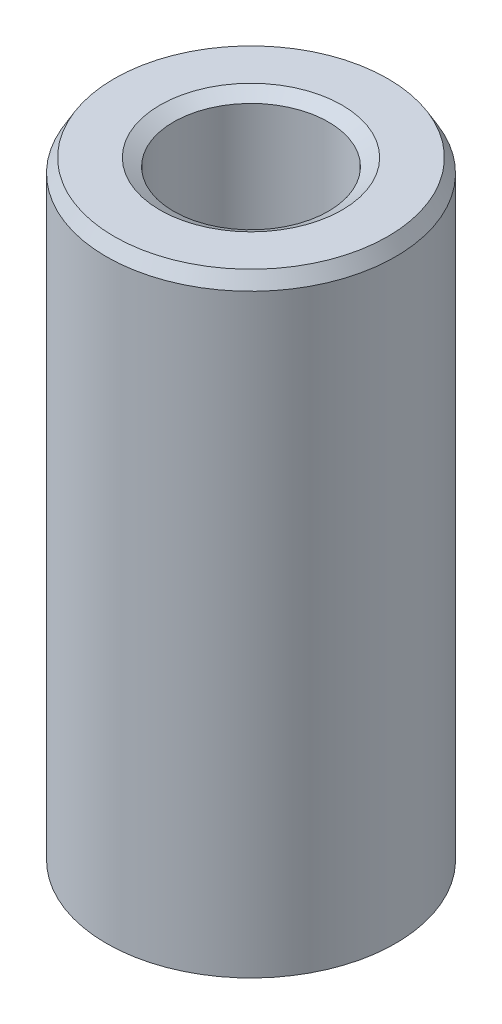
ISO-10303-21;
HEADER;
FILE_DESCRIPTION(('STEP AP214'),'2;1');
FILE_NAME('part.step','',(''),(''),'','','');
FILE_SCHEMA(('AUTOMOTIVE_DESIGN { 1 0 10303 214 1 1 1 1 }'));
ENDSEC;
DATA;
#1=APPLICATION_CONTEXT('core data for automotive mechanical design processes');
#2=APPLICATION_PROTOCOL_DEFINITION('international standard','automotive_design',2000,#1);
#3=PRODUCT_CONTEXT('',#1,'mechanical');
#4=PRODUCT('Part','Part','',(#3));
#5=PRODUCT_RELATED_PRODUCT_CATEGORY('part','',(#4));
#6=PRODUCT_DEFINITION_FORMATION('','',#4);
#7=PRODUCT_DEFINITION_CONTEXT('part definition',#1,'design');
#8=PRODUCT_DEFINITION('design','',#6,#7);
#9=PRODUCT_DEFINITION_SHAPE('','',#8);
#10=(LENGTH_UNIT() NAMED_UNIT(*) SI_UNIT(.MILLI.,.METRE.));
#11=(NAMED_UNIT(*) PLANE_ANGLE_UNIT() SI_UNIT($,.RADIAN.));
#12=(NAMED_UNIT(*) SI_UNIT($,.STERADIAN.) SOLID_ANGLE_UNIT());
#13=UNCERTAINTY_MEASURE_WITH_UNIT(LENGTH_MEASURE(1.E-05),#10,'distance_accuracy_value','');
#14=(GEOMETRIC_REPRESENTATION_CONTEXT(3) GLOBAL_UNCERTAINTY_ASSIGNED_CONTEXT((#13)) GLOBAL_UNIT_ASSIGNED_CONTEXT((#10,
#11,#12)) REPRESENTATION_CONTEXT('',''));
#15=CARTESIAN_POINT('',(0.,0.,0.));
#16=DIRECTION('',(0.,0.,1.));
#17=DIRECTION('',(1.,0.,0.));
#18=AXIS2_PLACEMENT_3D('',#15,#16,#17);
#19=CARTESIAN_POINT('',(0.,95.8578703306139,0.));
#20=DIRECTION('',(0.,-1.,0.));
#21=DIRECTION('',(0.,0.,-1.));
#22=AXIS2_PLACEMENT_3D('',#19,#20,#21);
#23=CYLINDRICAL_SURFACE('',#22,22.5);
#24=CARTESIAN_POINT('',(0.,1.21915399712182,0.));
#25=DIRECTION('',(0.,1.,0.));
#26=DIRECTION('',(0.,0.,1.));
#27=AXIS2_PLACEMENT_3D('',#24,#25,#26);
#28=CIRCLE('',#27,22.5);
#29=CARTESIAN_POINT('',(0.,1.21915399712182,22.5));
#30=VERTEX_POINT('',#29);
#31=EDGE_CURVE('E10',#30,#30,#28,.T.);
#32=ORIENTED_EDGE('',*,*,#31,.T.);
#33=EDGE_LOOP('',(#32));
#34=FACE_BOUND('',#33,.T.);
#35=CARTESIAN_POINT('',(0.,93.7462336653483,0.));
#36=DIRECTION('',(0.,1.,0.));
#37=DIRECTION('',(0.,0.,1.));
#38=AXIS2_PLACEMENT_3D('',#35,#36,#37);
#39=CIRCLE('',#38,22.5);
#40=CARTESIAN_POINT('',(0.,93.7462336653483,22.5));
#41=VERTEX_POINT('',#40);
#42=EDGE_CURVE('E50',#41,#41,#39,.F.);
#43=ORIENTED_EDGE('',*,*,#42,.T.);
#44=EDGE_LOOP('',(#43));
#45=FACE_BOUND('',#44,.T.);
#46=ADVANCED_FACE('F39',(#34,#45),#23,.T.);
#47=CARTESIAN_POINT('',(0.,95.8578703306139,0.));
#48=DIRECTION('',(0.,1.,0.));
#49=DIRECTION('',(0.,0.,1.));
#50=AXIS2_PLACEMENT_3D('',#47,#48,#49);
#51=PLANE('',#50);
#52=CARTESIAN_POINT('',(0.,95.8578703306139,0.));
#53=DIRECTION('',(0.,1.,0.));
#54=DIRECTION('',(0.,0.,1.));
#55=AXIS2_PLACEMENT_3D('',#52,#53,#54);
#56=CIRCLE('',#55,14.1580159167002);
#57=CARTESIAN_POINT('',(0.,95.8578703306139,14.1580159167002));
#58=VERTEX_POINT('',#57);
#59=EDGE_CURVE('E58',#58,#58,#56,.F.);
#60=ORIENTED_EDGE('',*,*,#59,.T.);
#61=EDGE_LOOP('',(#60));
#62=FACE_BOUND('',#61,.T.);
#63=CARTESIAN_POINT('',(0.,95.8578703306139,0.));
#64=DIRECTION('',(0.,1.,0.));
#65=DIRECTION('',(0.,0.,1.));
#66=AXIS2_PLACEMENT_3D('',#63,#64,#65);
#67=CIRCLE('',#66,21.2808460028782);
#68=CARTESIAN_POINT('',(0.,95.8578703306139,21.2808460028782));
#69=VERTEX_POINT('',#68);
#70=EDGE_CURVE('E61',#69,#69,#67,.T.);
#71=ORIENTED_EDGE('',*,*,#70,.T.);
#72=EDGE_LOOP('',(#71));
#73=FACE_BOUND('',#72,.T.);
#74=ADVANCED_FACE('F88',(#62,#73),#51,.T.);
#75=CARTESIAN_POINT('',(0.,0.,0.));
#76=DIRECTION('',(0.,1.,0.));
#77=DIRECTION('',(0.,0.,1.));
#78=AXIS2_PLACEMENT_3D('',#75,#76,#77);
#79=PLANE('',#78);
#80=CARTESIAN_POINT('',(0.,0.,0.));
#81=DIRECTION('',(0.,1.,0.));
#82=DIRECTION('',(0.,0.,1.));
#83=AXIS2_PLACEMENT_3D('',#80,#81,#82);
#84=CIRCLE('',#83,13.2655332485563);
#85=CARTESIAN_POINT('',(0.,0.,13.2655332485563));
#86=VERTEX_POINT('',#85);
#87=EDGE_CURVE('E51',#86,#86,#84,.T.);
#88=ORIENTED_EDGE('',*,*,#87,.T.);
#89=EDGE_LOOP('',(#88));
#90=FACE_BOUND('',#89,.T.);
#91=CARTESIAN_POINT('',(0.,0.,0.));
#92=DIRECTION('',(0.,1.,0.));
#93=DIRECTION('',(0.,0.,1.));
#94=AXIS2_PLACEMENT_3D('',#91,#92,#93);
#95=CIRCLE('',#94,20.3883633347343);
#96=CARTESIAN_POINT('',(0.,0.,20.3883633347343));
#97=VERTEX_POINT('',#96);
#98=EDGE_CURVE('E54',#97,#97,#95,.F.);
#99=ORIENTED_EDGE('',*,*,#98,.T.);
#100=EDGE_LOOP('',(#99));
#101=FACE_BOUND('',#100,.T.);
#102=ADVANCED_FACE('F83',(#90,#101),#79,.F.);
#103=CARTESIAN_POINT('',(0.,95.8578703306139,0.));
#104=DIRECTION('',(0.,-1.,0.));
#105=DIRECTION('',(0.,0.,-1.));
#106=AXIS2_PLACEMENT_3D('',#103,#104,#105);
#107=CYLINDRICAL_SURFACE('',#106,12.0463792514345);
#108=CARTESIAN_POINT('',(0.,94.6387163334921,0.));
#109=DIRECTION('',(0.,1.,0.));
#110=DIRECTION('',(0.,0.,1.));
#111=AXIS2_PLACEMENT_3D('',#108,#109,#110);
#112=CIRCLE('',#111,12.0463792514345);
#113=CARTESIAN_POINT('',(0.,94.6387163334921,12.0463792514345));
#114=VERTEX_POINT('',#113);
#115=EDGE_CURVE('E67',#114,#114,#112,.T.);
#116=ORIENTED_EDGE('',*,*,#115,.T.);
#117=EDGE_LOOP('',(#116));
#118=FACE_BOUND('',#117,.T.);
#119=CARTESIAN_POINT('',(0.,2.11163666526569,0.));
#120=DIRECTION('',(0.,1.,0.));
#121=DIRECTION('',(0.,0.,1.));
#122=AXIS2_PLACEMENT_3D('',#119,#120,#121);
#123=CIRCLE('',#122,12.0463792514345);
#124=CARTESIAN_POINT('',(0.,2.11163666526569,12.0463792514345));
#125=VERTEX_POINT('',#124);
#126=EDGE_CURVE('E69',#125,#125,#123,.F.);
#127=ORIENTED_EDGE('',*,*,#126,.T.);
#128=EDGE_LOOP('',(#127));
#129=FACE_BOUND('',#128,.T.);
#130=ADVANCED_FACE('F71',(#118,#129),#107,.F.);
#131=CARTESIAN_POINT('',(0.,94.6387163334921,0.));
#132=DIRECTION('',(0.,1.,0.));
#133=DIRECTION('',(0.,0.,1.));
#134=AXIS2_PLACEMENT_3D('',#131,#132,#133);
#135=CONICAL_SURFACE('',#134,12.0463792514345,1.04719755119661);
#136=ORIENTED_EDGE('',*,*,#59,.F.);
#137=EDGE_LOOP('',(#136));
#138=FACE_BOUND('',#137,.T.);
#139=ORIENTED_EDGE('',*,*,#115,.F.);
#140=EDGE_LOOP('',(#139));
#141=FACE_BOUND('',#140,.T.);
#142=ADVANCED_FACE('F77',(#138,#141),#135,.F.);
#143=CARTESIAN_POINT('',(0.,0.,0.));
#144=DIRECTION('',(0.,-1.,0.));
#145=DIRECTION('',(0.,0.,-1.));
#146=AXIS2_PLACEMENT_3D('',#143,#144,#145);
#147=CONICAL_SURFACE('',#146,13.2655332485563,0.523598775598295);
#148=ORIENTED_EDGE('',*,*,#126,.F.);
#149=EDGE_LOOP('',(#148));
#150=FACE_BOUND('',#149,.T.);
#151=ORIENTED_EDGE('',*,*,#87,.F.);
#152=EDGE_LOOP('',(#151));
#153=FACE_BOUND('',#152,.T.);
#154=ADVANCED_FACE('F73',(#150,#153),#147,.F.);
#155=CARTESIAN_POINT('',(0.,1.21915399712182,0.));
#156=DIRECTION('',(0.,1.,0.));
#157=DIRECTION('',(0.,0.,1.));
#158=AXIS2_PLACEMENT_3D('',#155,#156,#157);
#159=CONICAL_SURFACE('',#158,22.5,1.0471975511966);
#160=ORIENTED_EDGE('',*,*,#98,.F.);
#161=EDGE_LOOP('',(#160));
#162=FACE_BOUND('',#161,.T.);
#163=ORIENTED_EDGE('',*,*,#31,.F.);
#164=EDGE_LOOP('',(#163));
#165=FACE_BOUND('',#164,.T.);
#166=ADVANCED_FACE('F76',(#162,#165),#159,.T.);
#167=CARTESIAN_POINT('',(0.,95.8578703306139,0.));
#168=DIRECTION('',(0.,-1.,0.));
#169=DIRECTION('',(0.,0.,-1.));
#170=AXIS2_PLACEMENT_3D('',#167,#168,#169);
#171=CONICAL_SURFACE('',#170,21.2808460028782,0.523598775598298);
#172=ORIENTED_EDGE('',*,*,#42,.F.);
#173=EDGE_LOOP('',(#172));
#174=FACE_BOUND('',#173,.T.);
#175=ORIENTED_EDGE('',*,*,#70,.F.);
#176=EDGE_LOOP('',(#175));
#177=FACE_BOUND('',#176,.T.);
#178=ADVANCED_FACE('F45',(#174,#177),#171,.T.);
#179=CLOSED_SHELL('',(#46,#74,#102,#130,#142,#154,#166,#178));
#180=MANIFOLD_SOLID_BREP('B2',#179);
#181=ADVANCED_BREP_SHAPE_REPRESENTATION('',(#18,#180),#14);
#182=SHAPE_DEFINITION_REPRESENTATION(#9,#181);
ENDSEC;
END-ISO-10303-21;
